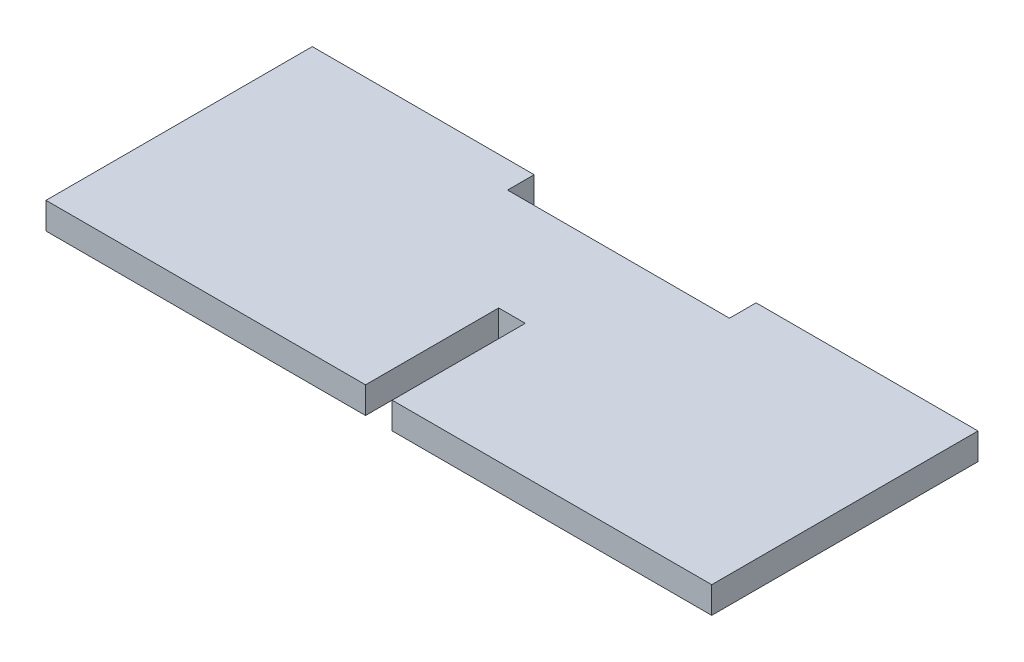
ISO-10303-21;
HEADER;
FILE_DESCRIPTION(('STEP AP214'),'2;1');
FILE_NAME('part.step','',(''),(''),'','','');
FILE_SCHEMA(('AUTOMOTIVE_DESIGN { 1 0 10303 214 1 1 1 1 }'));
ENDSEC;
DATA;
#1=APPLICATION_CONTEXT('core data for automotive mechanical design processes');
#2=APPLICATION_PROTOCOL_DEFINITION('international standard','automotive_design',2000,#1);
#3=PRODUCT_CONTEXT('',#1,'mechanical');
#4=PRODUCT('Part','Part','',(#3));
#5=PRODUCT_RELATED_PRODUCT_CATEGORY('part','',(#4));
#6=PRODUCT_DEFINITION_FORMATION('','',#4);
#7=PRODUCT_DEFINITION_CONTEXT('part definition',#1,'design');
#8=PRODUCT_DEFINITION('design','',#6,#7);
#9=PRODUCT_DEFINITION_SHAPE('','',#8);
#10=(LENGTH_UNIT() NAMED_UNIT(*) SI_UNIT(.MILLI.,.METRE.));
#11=(NAMED_UNIT(*) PLANE_ANGLE_UNIT() SI_UNIT($,.RADIAN.));
#12=(NAMED_UNIT(*) SI_UNIT($,.STERADIAN.) SOLID_ANGLE_UNIT());
#13=UNCERTAINTY_MEASURE_WITH_UNIT(LENGTH_MEASURE(1.E-05),#10,'distance_accuracy_value','');
#14=(GEOMETRIC_REPRESENTATION_CONTEXT(3) GLOBAL_UNCERTAINTY_ASSIGNED_CONTEXT((#13)) GLOBAL_UNIT_ASSIGNED_CONTEXT((#10,
#11,#12)) REPRESENTATION_CONTEXT('',''));
#15=CARTESIAN_POINT('',(0.,0.,0.));
#16=DIRECTION('',(0.,0.,1.));
#17=DIRECTION('',(1.,0.,0.));
#18=AXIS2_PLACEMENT_3D('',#15,#16,#17);
#19=CARTESIAN_POINT('',(0.,3.,-7.33173076923077));
#20=DIRECTION('',(0.,0.,-1.));
#21=DIRECTION('',(-1.,0.,0.));
#22=AXIS2_PLACEMENT_3D('',#19,#20,#21);
#23=PLANE('',#22);
#24=DIRECTION('',(0.,-1.,0.));
#25=VECTOR('',#24,1.);
#26=CARTESIAN_POINT('',(11.,6.69253346012569,-7.33173076923077));
#27=LINE('',#26,#25);
#28=CARTESIAN_POINT('',(11.,3.,-7.33173076923077));
#29=VERTEX_POINT('',#28);
#30=CARTESIAN_POINT('',(11.,0.,-7.33173076923077));
#31=VERTEX_POINT('',#30);
#32=EDGE_CURVE('E204',#29,#31,#27,.T.);
#33=ORIENTED_EDGE('',*,*,#32,.F.);
#34=DIRECTION('',(1.,0.,0.));
#35=VECTOR('',#34,1.);
#36=CARTESIAN_POINT('',(0.,3.,-7.33173076923077));
#37=LINE('',#36,#35);
#38=CARTESIAN_POINT('',(36.,3.,-7.33173076923077));
#39=VERTEX_POINT('',#38);
#40=EDGE_CURVE('E59',#29,#39,#37,.T.);
#41=ORIENTED_EDGE('',*,*,#40,.T.);
#42=DIRECTION('',(0.,-1.,0.));
#43=VECTOR('',#42,1.);
#44=CARTESIAN_POINT('',(36.,3.,-7.33173076923077));
#45=LINE('',#44,#43);
#46=CARTESIAN_POINT('',(36.,0.,-7.33173076923077));
#47=VERTEX_POINT('',#46);
#48=EDGE_CURVE('E147',#39,#47,#45,.T.);
#49=ORIENTED_EDGE('',*,*,#48,.T.);
#50=DIRECTION('',(1.,0.,0.));
#51=VECTOR('',#50,1.);
#52=CARTESIAN_POINT('',(0.,0.,-7.33173076923077));
#53=LINE('',#52,#51);
#54=EDGE_CURVE('E93',#31,#47,#53,.T.);
#55=ORIENTED_EDGE('',*,*,#54,.F.);
#56=EDGE_LOOP('',(#33,#41,#49,#55));
#57=FACE_BOUND('',#56,.T.);
#58=ADVANCED_FACE('F35',(#57),#23,.T.);
#59=DIRECTION('',(0.,1.,0.));
#60=VECTOR('',#59,1.);
#61=CARTESIAN_POINT('',(-14.,6.69253346012569,-7.33173076923077));
#62=LINE('',#61,#60);
#63=CARTESIAN_POINT('',(-14.,0.,-7.33173076923077));
#64=VERTEX_POINT('',#63);
#65=CARTESIAN_POINT('',(-14.,3.,-7.33173076923077));
#66=VERTEX_POINT('',#65);
#67=EDGE_CURVE('E196',#64,#66,#62,.T.);
#68=ORIENTED_EDGE('',*,*,#67,.F.);
#69=CARTESIAN_POINT('',(-39.,0.,-7.33173076923077));
#70=VERTEX_POINT('',#69);
#71=EDGE_CURVE('E151',#70,#64,#53,.T.);
#72=ORIENTED_EDGE('',*,*,#71,.F.);
#73=DIRECTION('',(0.,-1.,0.));
#74=VECTOR('',#73,1.);
#75=CARTESIAN_POINT('',(-39.,3.,-7.33173076923077));
#76=LINE('',#75,#74);
#77=CARTESIAN_POINT('',(-39.,3.,-7.33173076923077));
#78=VERTEX_POINT('',#77);
#79=EDGE_CURVE('E100',#78,#70,#76,.T.);
#80=ORIENTED_EDGE('',*,*,#79,.F.);
#81=EDGE_CURVE('E203',#78,#66,#37,.T.);
#82=ORIENTED_EDGE('',*,*,#81,.T.);
#83=EDGE_LOOP('',(#68,#72,#80,#82));
#84=FACE_BOUND('',#83,.T.);
#85=ADVANCED_FACE('F37',(#84),#23,.T.);
#86=CARTESIAN_POINT('',(-39.,3.,0.));
#87=DIRECTION('',(1.,0.,0.));
#88=DIRECTION('',(0.,0.,-1.));
#89=AXIS2_PLACEMENT_3D('',#86,#87,#88);
#90=PLANE('',#89);
#91=DIRECTION('',(0.,0.,1.));
#92=VECTOR('',#91,1.);
#93=CARTESIAN_POINT('',(-39.,0.,0.));
#94=LINE('',#93,#92);
#95=CARTESIAN_POINT('',(-39.,0.,22.6682692307692));
#96=VERTEX_POINT('',#95);
#97=EDGE_CURVE('E154',#70,#96,#94,.T.);
#98=ORIENTED_EDGE('',*,*,#97,.T.);
#99=DIRECTION('',(0.,-1.,0.));
#100=VECTOR('',#99,1.);
#101=CARTESIAN_POINT('',(-39.,3.,22.6682692307692));
#102=LINE('',#101,#100);
#103=CARTESIAN_POINT('',(-39.,3.,22.6682692307692));
#104=VERTEX_POINT('',#103);
#105=EDGE_CURVE('E176',#104,#96,#102,.T.);
#106=ORIENTED_EDGE('',*,*,#105,.F.);
#107=DIRECTION('',(0.,0.,1.));
#108=VECTOR('',#107,1.);
#109=CARTESIAN_POINT('',(-39.,3.,0.));
#110=LINE('',#109,#108);
#111=EDGE_CURVE('E220',#78,#104,#110,.T.);
#112=ORIENTED_EDGE('',*,*,#111,.F.);
#113=ORIENTED_EDGE('',*,*,#79,.T.);
#114=EDGE_LOOP('',(#98,#106,#112,#113));
#115=FACE_BOUND('',#114,.T.);
#116=ADVANCED_FACE('F251',(#115),#90,.F.);
#117=CARTESIAN_POINT('',(0.,3.,22.6682692307692));
#118=DIRECTION('',(0.,0.,-1.));
#119=DIRECTION('',(-1.,0.,0.));
#120=AXIS2_PLACEMENT_3D('',#117,#118,#119);
#121=PLANE('',#120);
#122=DIRECTION('',(1.,0.,0.));
#123=VECTOR('',#122,1.);
#124=CARTESIAN_POINT('',(0.,0.,22.6682692307692));
#125=LINE('',#124,#123);
#126=CARTESIAN_POINT('',(-3.,0.,22.6682692307692));
#127=VERTEX_POINT('',#126);
#128=EDGE_CURVE('E156',#96,#127,#125,.T.);
#129=ORIENTED_EDGE('',*,*,#128,.T.);
#130=DIRECTION('',(0.,-1.,0.));
#131=VECTOR('',#130,1.);
#132=CARTESIAN_POINT('',(-3.,3.,22.6682692307692));
#133=LINE('',#132,#131);
#134=CARTESIAN_POINT('',(-3.,3.,22.6682692307692));
#135=VERTEX_POINT('',#134);
#136=EDGE_CURVE('E173',#135,#127,#133,.T.);
#137=ORIENTED_EDGE('',*,*,#136,.F.);
#138=DIRECTION('',(1.,0.,0.));
#139=VECTOR('',#138,1.);
#140=CARTESIAN_POINT('',(0.,3.,22.6682692307692));
#141=LINE('',#140,#139);
#142=EDGE_CURVE('E222',#104,#135,#141,.T.);
#143=ORIENTED_EDGE('',*,*,#142,.F.);
#144=ORIENTED_EDGE('',*,*,#105,.T.);
#145=EDGE_LOOP('',(#129,#137,#143,#144));
#146=FACE_BOUND('',#145,.T.);
#147=ADVANCED_FACE('F256',(#146),#121,.F.);
#148=CARTESIAN_POINT('',(-3.,3.,0.));
#149=DIRECTION('',(-1.,0.,0.));
#150=DIRECTION('',(0.,0.,1.));
#151=AXIS2_PLACEMENT_3D('',#148,#149,#150);
#152=PLANE('',#151);
#153=DIRECTION('',(0.,0.,-1.));
#154=VECTOR('',#153,1.);
#155=CARTESIAN_POINT('',(-3.,0.,0.));
#156=LINE('',#155,#154);
#157=CARTESIAN_POINT('',(-3.,0.,7.66826923076923));
#158=VERTEX_POINT('',#157);
#159=EDGE_CURVE('E158',#127,#158,#156,.T.);
#160=ORIENTED_EDGE('',*,*,#159,.T.);
#161=DIRECTION('',(0.,-1.,0.));
#162=VECTOR('',#161,1.);
#163=CARTESIAN_POINT('',(-3.,3.,7.66826923076923));
#164=LINE('',#163,#162);
#165=CARTESIAN_POINT('',(-3.,3.,7.66826923076923));
#166=VERTEX_POINT('',#165);
#167=EDGE_CURVE('E170',#166,#158,#164,.T.);
#168=ORIENTED_EDGE('',*,*,#167,.F.);
#169=DIRECTION('',(0.,0.,-1.));
#170=VECTOR('',#169,1.);
#171=CARTESIAN_POINT('',(-3.,3.,0.));
#172=LINE('',#171,#170);
#173=EDGE_CURVE('E224',#135,#166,#172,.T.);
#174=ORIENTED_EDGE('',*,*,#173,.F.);
#175=ORIENTED_EDGE('',*,*,#136,.T.);
#176=EDGE_LOOP('',(#160,#168,#174,#175));
#177=FACE_BOUND('',#176,.T.);
#178=ADVANCED_FACE('F230',(#177),#152,.F.);
#179=CARTESIAN_POINT('',(0.,3.,7.66826923076923));
#180=DIRECTION('',(0.,0.,-1.));
#181=DIRECTION('',(-1.,0.,0.));
#182=AXIS2_PLACEMENT_3D('',#179,#180,#181);
#183=PLANE('',#182);
#184=DIRECTION('',(1.,0.,0.));
#185=VECTOR('',#184,1.);
#186=CARTESIAN_POINT('',(0.,0.,7.66826923076923));
#187=LINE('',#186,#185);
#188=CARTESIAN_POINT('',(0.,0.,7.66826923076923));
#189=VERTEX_POINT('',#188);
#190=EDGE_CURVE('E160',#158,#189,#187,.T.);
#191=ORIENTED_EDGE('',*,*,#190,.T.);
#192=DIRECTION('',(0.,-1.,0.));
#193=VECTOR('',#192,1.);
#194=CARTESIAN_POINT('',(0.,3.,7.66826923076923));
#195=LINE('',#194,#193);
#196=CARTESIAN_POINT('',(0.,3.,7.66826923076923));
#197=VERTEX_POINT('',#196);
#198=EDGE_CURVE('E140',#197,#189,#195,.T.);
#199=ORIENTED_EDGE('',*,*,#198,.F.);
#200=DIRECTION('',(1.,0.,0.));
#201=VECTOR('',#200,1.);
#202=CARTESIAN_POINT('',(0.,3.,7.66826923076923));
#203=LINE('',#202,#201);
#204=EDGE_CURVE('E127',#166,#197,#203,.T.);
#205=ORIENTED_EDGE('',*,*,#204,.F.);
#206=ORIENTED_EDGE('',*,*,#167,.T.);
#207=EDGE_LOOP('',(#191,#199,#205,#206));
#208=FACE_BOUND('',#207,.T.);
#209=ADVANCED_FACE('F234',(#208),#183,.F.);
#210=CARTESIAN_POINT('',(0.,3.,0.));
#211=DIRECTION('',(1.,0.,0.));
#212=DIRECTION('',(0.,0.,-1.));
#213=AXIS2_PLACEMENT_3D('',#210,#211,#212);
#214=PLANE('',#213);
#215=DIRECTION('',(0.,0.,1.));
#216=VECTOR('',#215,1.);
#217=CARTESIAN_POINT('',(0.,0.,0.));
#218=LINE('',#217,#216);
#219=CARTESIAN_POINT('',(0.,0.,22.6682692307692));
#220=VERTEX_POINT('',#219);
#221=EDGE_CURVE('E136',#189,#220,#218,.T.);
#222=ORIENTED_EDGE('',*,*,#221,.T.);
#223=DIRECTION('',(0.,-1.,0.));
#224=VECTOR('',#223,1.);
#225=CARTESIAN_POINT('',(0.,3.,22.6682692307692));
#226=LINE('',#225,#224);
#227=CARTESIAN_POINT('',(0.,3.,22.6682692307692));
#228=VERTEX_POINT('',#227);
#229=EDGE_CURVE('E133',#228,#220,#226,.T.);
#230=ORIENTED_EDGE('',*,*,#229,.F.);
#231=DIRECTION('',(0.,0.,1.));
#232=VECTOR('',#231,1.);
#233=CARTESIAN_POINT('',(0.,3.,0.));
#234=LINE('',#233,#232);
#235=EDGE_CURVE('E118',#197,#228,#234,.T.);
#236=ORIENTED_EDGE('',*,*,#235,.F.);
#237=ORIENTED_EDGE('',*,*,#198,.T.);
#238=EDGE_LOOP('',(#222,#230,#236,#237));
#239=FACE_BOUND('',#238,.T.);
#240=ADVANCED_FACE('F134',(#239),#214,.F.);
#241=CARTESIAN_POINT('',(0.,3.,22.6682692307692));
#242=DIRECTION('',(0.,0.,-1.));
#243=DIRECTION('',(-1.,0.,0.));
#244=AXIS2_PLACEMENT_3D('',#241,#242,#243);
#245=PLANE('',#244);
#246=DIRECTION('',(1.,0.,0.));
#247=VECTOR('',#246,1.);
#248=CARTESIAN_POINT('',(0.,0.,22.6682692307692));
#249=LINE('',#248,#247);
#250=CARTESIAN_POINT('',(36.,0.,22.6682692307692));
#251=VERTEX_POINT('',#250);
#252=EDGE_CURVE('E163',#220,#251,#249,.T.);
#253=ORIENTED_EDGE('',*,*,#252,.T.);
#254=DIRECTION('',(0.,-1.,0.));
#255=VECTOR('',#254,1.);
#256=CARTESIAN_POINT('',(36.,3.,22.6682692307692));
#257=LINE('',#256,#255);
#258=CARTESIAN_POINT('',(36.,3.,22.6682692307692));
#259=VERTEX_POINT('',#258);
#260=EDGE_CURVE('E141',#259,#251,#257,.T.);
#261=ORIENTED_EDGE('',*,*,#260,.F.);
#262=DIRECTION('',(1.,0.,0.));
#263=VECTOR('',#262,1.);
#264=CARTESIAN_POINT('',(0.,3.,22.6682692307692));
#265=LINE('',#264,#263);
#266=EDGE_CURVE('E124',#228,#259,#265,.T.);
#267=ORIENTED_EDGE('',*,*,#266,.F.);
#268=ORIENTED_EDGE('',*,*,#229,.T.);
#269=EDGE_LOOP('',(#253,#261,#267,#268));
#270=FACE_BOUND('',#269,.T.);
#271=ADVANCED_FACE('F143',(#270),#245,.F.);
#272=CARTESIAN_POINT('',(36.,3.,0.));
#273=DIRECTION('',(1.,0.,0.));
#274=DIRECTION('',(0.,0.,-1.));
#275=AXIS2_PLACEMENT_3D('',#272,#273,#274);
#276=PLANE('',#275);
#277=DIRECTION('',(0.,0.,1.));
#278=VECTOR('',#277,1.);
#279=CARTESIAN_POINT('',(36.,0.,0.));
#280=LINE('',#279,#278);
#281=EDGE_CURVE('E165',#47,#251,#280,.T.);
#282=ORIENTED_EDGE('',*,*,#281,.F.);
#283=ORIENTED_EDGE('',*,*,#48,.F.);
#284=DIRECTION('',(0.,0.,1.));
#285=VECTOR('',#284,1.);
#286=CARTESIAN_POINT('',(36.,3.,0.));
#287=LINE('',#286,#285);
#288=EDGE_CURVE('E145',#39,#259,#287,.T.);
#289=ORIENTED_EDGE('',*,*,#288,.T.);
#290=ORIENTED_EDGE('',*,*,#260,.T.);
#291=EDGE_LOOP('',(#282,#283,#289,#290));
#292=FACE_BOUND('',#291,.T.);
#293=ADVANCED_FACE('F237',(#292),#276,.T.);
#294=CARTESIAN_POINT('',(0.,3.,0.));
#295=DIRECTION('',(0.,1.,0.));
#296=DIRECTION('',(0.,0.,1.));
#297=AXIS2_PLACEMENT_3D('',#294,#295,#296);
#298=PLANE('',#297);
#299=DIRECTION('',(0.,0.,-1.));
#300=VECTOR('',#299,1.);
#301=CARTESIAN_POINT('',(11.,3.,0.));
#302=LINE('',#301,#300);
#303=CARTESIAN_POINT('',(11.,3.,-4.33173076923077));
#304=VERTEX_POINT('',#303);
#305=EDGE_CURVE('E216',#304,#29,#302,.T.);
#306=ORIENTED_EDGE('',*,*,#305,.F.);
#307=DIRECTION('',(-1.,0.,0.));
#308=VECTOR('',#307,1.);
#309=CARTESIAN_POINT('',(0.,3.,-4.33173076923077));
#310=LINE('',#309,#308);
#311=CARTESIAN_POINT('',(-14.,3.,-4.33173076923077));
#312=VERTEX_POINT('',#311);
#313=EDGE_CURVE('E211',#304,#312,#310,.T.);
#314=ORIENTED_EDGE('',*,*,#313,.T.);
#315=DIRECTION('',(0.,0.,1.));
#316=VECTOR('',#315,1.);
#317=CARTESIAN_POINT('',(-14.,3.,0.));
#318=LINE('',#317,#316);
#319=EDGE_CURVE('E214',#66,#312,#318,.T.);
#320=ORIENTED_EDGE('',*,*,#319,.F.);
#321=ORIENTED_EDGE('',*,*,#81,.F.);
#322=ORIENTED_EDGE('',*,*,#111,.T.);
#323=ORIENTED_EDGE('',*,*,#142,.T.);
#324=ORIENTED_EDGE('',*,*,#173,.T.);
#325=ORIENTED_EDGE('',*,*,#204,.T.);
#326=ORIENTED_EDGE('',*,*,#235,.T.);
#327=ORIENTED_EDGE('',*,*,#266,.T.);
#328=ORIENTED_EDGE('',*,*,#288,.F.);
#329=ORIENTED_EDGE('',*,*,#40,.F.);
#330=EDGE_LOOP('',(#306,#314,#320,#321,#322,#323,#324,#325,#326,#327,#328,#329));
#331=FACE_BOUND('',#330,.T.);
#332=ADVANCED_FACE('F121',(#331),#298,.T.);
#333=CARTESIAN_POINT('',(0.,0.,0.));
#334=DIRECTION('',(0.,1.,0.));
#335=DIRECTION('',(0.,0.,1.));
#336=AXIS2_PLACEMENT_3D('',#333,#334,#335);
#337=PLANE('',#336);
#338=DIRECTION('',(-1.,0.,0.));
#339=VECTOR('',#338,1.);
#340=CARTESIAN_POINT('',(0.,0.,-4.33173076923077));
#341=LINE('',#340,#339);
#342=CARTESIAN_POINT('',(11.,0.,-4.33173076923077));
#343=VERTEX_POINT('',#342);
#344=CARTESIAN_POINT('',(-14.,0.,-4.33173076923077));
#345=VERTEX_POINT('',#344);
#346=EDGE_CURVE('E180',#343,#345,#341,.T.);
#347=ORIENTED_EDGE('',*,*,#346,.F.);
#348=DIRECTION('',(0.,0.,-1.));
#349=VECTOR('',#348,1.);
#350=CARTESIAN_POINT('',(11.,0.,0.));
#351=LINE('',#350,#349);
#352=EDGE_CURVE('E11',#343,#31,#351,.T.);
#353=ORIENTED_EDGE('',*,*,#352,.T.);
#354=ORIENTED_EDGE('',*,*,#54,.T.);
#355=ORIENTED_EDGE('',*,*,#281,.T.);
#356=ORIENTED_EDGE('',*,*,#252,.F.);
#357=ORIENTED_EDGE('',*,*,#221,.F.);
#358=ORIENTED_EDGE('',*,*,#190,.F.);
#359=ORIENTED_EDGE('',*,*,#159,.F.);
#360=ORIENTED_EDGE('',*,*,#128,.F.);
#361=ORIENTED_EDGE('',*,*,#97,.F.);
#362=ORIENTED_EDGE('',*,*,#71,.T.);
#363=DIRECTION('',(0.,0.,1.));
#364=VECTOR('',#363,1.);
#365=CARTESIAN_POINT('',(-14.,0.,0.));
#366=LINE('',#365,#364);
#367=EDGE_CURVE('E43',#64,#345,#366,.T.);
#368=ORIENTED_EDGE('',*,*,#367,.T.);
#369=EDGE_LOOP('',(#347,#353,#354,#355,#356,#357,#358,#359,#360,#361,#362,#368));
#370=FACE_BOUND('',#369,.T.);
#371=ADVANCED_FACE('F185',(#370),#337,.F.);
#372=CARTESIAN_POINT('',(11.,6.69253346012569,-4.33173076923077));
#373=DIRECTION('',(1.,0.,0.));
#374=DIRECTION('',(0.,1.,0.));
#375=AXIS2_PLACEMENT_3D('',#372,#373,#374);
#376=PLANE('',#375);
#377=ORIENTED_EDGE('',*,*,#305,.T.);
#378=ORIENTED_EDGE('',*,*,#32,.T.);
#379=ORIENTED_EDGE('',*,*,#352,.F.);
#380=DIRECTION('',(0.,-1.,0.));
#381=VECTOR('',#380,1.);
#382=CARTESIAN_POINT('',(11.,6.69253346012569,-4.33173076923077));
#383=LINE('',#382,#381);
#384=EDGE_CURVE('E50',#304,#343,#383,.T.);
#385=ORIENTED_EDGE('',*,*,#384,.F.);
#386=EDGE_LOOP('',(#377,#378,#379,#385));
#387=FACE_BOUND('',#386,.T.);
#388=ADVANCED_FACE('F245',(#387),#376,.F.);
#389=CARTESIAN_POINT('',(-14.,6.69253346012569,-4.33173076923077));
#390=DIRECTION('',(-1.,0.,0.));
#391=DIRECTION('',(0.,0.,1.));
#392=AXIS2_PLACEMENT_3D('',#389,#390,#391);
#393=PLANE('',#392);
#394=ORIENTED_EDGE('',*,*,#319,.T.);
#395=DIRECTION('',(0.,1.,0.));
#396=VECTOR('',#395,1.);
#397=CARTESIAN_POINT('',(-14.,6.69253346012569,-4.33173076923077));
#398=LINE('',#397,#396);
#399=EDGE_CURVE('E199',#345,#312,#398,.T.);
#400=ORIENTED_EDGE('',*,*,#399,.F.);
#401=ORIENTED_EDGE('',*,*,#367,.F.);
#402=ORIENTED_EDGE('',*,*,#67,.T.);
#403=EDGE_LOOP('',(#394,#400,#401,#402));
#404=FACE_BOUND('',#403,.T.);
#405=ADVANCED_FACE('F194',(#404),#393,.F.);
#406=CARTESIAN_POINT('',(0.,0.,-4.33173076923077));
#407=DIRECTION('',(0.,0.,-1.));
#408=DIRECTION('',(-1.,0.,0.));
#409=AXIS2_PLACEMENT_3D('',#406,#407,#408);
#410=PLANE('',#409);
#411=ORIENTED_EDGE('',*,*,#384,.T.);
#412=ORIENTED_EDGE('',*,*,#346,.T.);
#413=ORIENTED_EDGE('',*,*,#399,.T.);
#414=ORIENTED_EDGE('',*,*,#313,.F.);
#415=EDGE_LOOP('',(#411,#412,#413,#414));
#416=FACE_BOUND('',#415,.T.);
#417=ADVANCED_FACE('F244',(#416),#410,.T.);
#418=CLOSED_SHELL('',(#58,#85,#116,#147,#178,#209,#240,#271,#293,#332,#371,#388,#405,#417));
#419=MANIFOLD_SOLID_BREP('B2',#418);
#420=ADVANCED_BREP_SHAPE_REPRESENTATION('',(#18,#419),#14);
#421=SHAPE_DEFINITION_REPRESENTATION(#9,#420);
ENDSEC;
END-ISO-10303-21;
